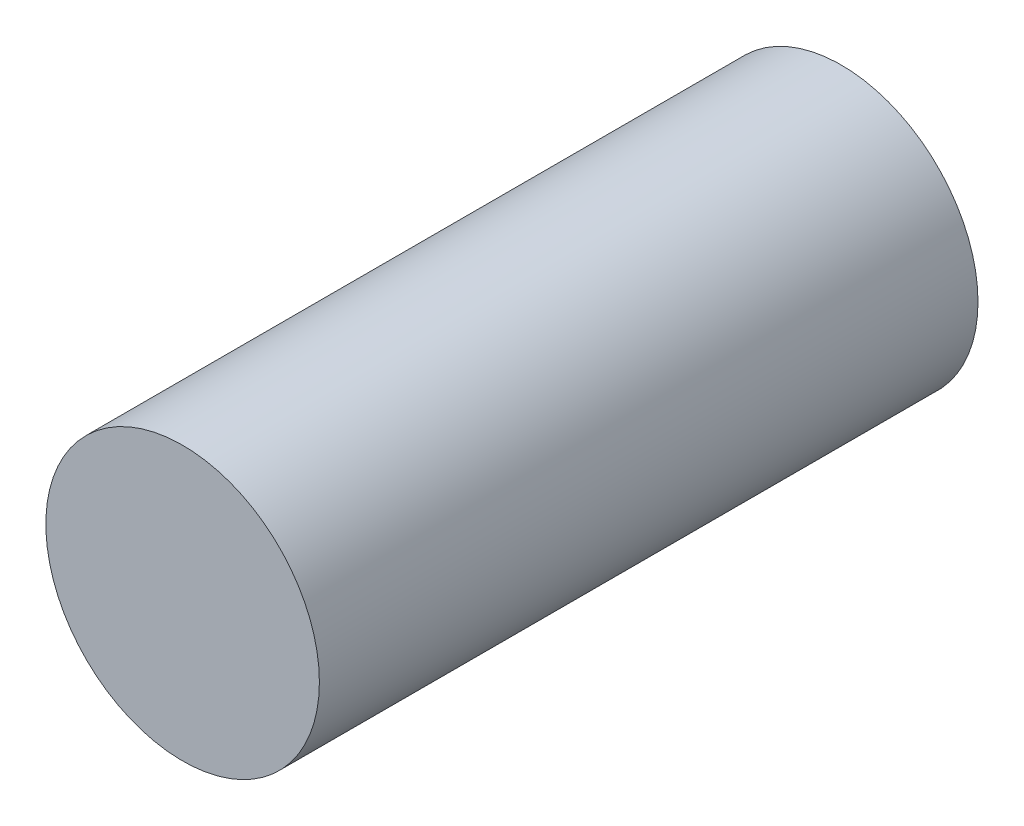
ISO-10303-21;
HEADER;
FILE_DESCRIPTION(('STEP AP214'),'2;1');
FILE_NAME('part.step','',(''),(''),'','','');
FILE_SCHEMA(('AUTOMOTIVE_DESIGN { 1 0 10303 214 1 1 1 1 }'));
ENDSEC;
DATA;
#1=APPLICATION_CONTEXT('core data for automotive mechanical design processes');
#2=APPLICATION_PROTOCOL_DEFINITION('international standard','automotive_design',2000,#1);
#3=PRODUCT_CONTEXT('',#1,'mechanical');
#4=PRODUCT('Part','Part','',(#3));
#5=PRODUCT_RELATED_PRODUCT_CATEGORY('part','',(#4));
#6=PRODUCT_DEFINITION_FORMATION('','',#4);
#7=PRODUCT_DEFINITION_CONTEXT('part definition',#1,'design');
#8=PRODUCT_DEFINITION('design','',#6,#7);
#9=PRODUCT_DEFINITION_SHAPE('','',#8);
#10=(LENGTH_UNIT() NAMED_UNIT(*) SI_UNIT(.MILLI.,.METRE.));
#11=(NAMED_UNIT(*) PLANE_ANGLE_UNIT() SI_UNIT($,.RADIAN.));
#12=(NAMED_UNIT(*) SI_UNIT($,.STERADIAN.) SOLID_ANGLE_UNIT());
#13=UNCERTAINTY_MEASURE_WITH_UNIT(LENGTH_MEASURE(1.E-05),#10,'distance_accuracy_value','');
#14=(GEOMETRIC_REPRESENTATION_CONTEXT(3) GLOBAL_UNCERTAINTY_ASSIGNED_CONTEXT((#13)) GLOBAL_UNIT_ASSIGNED_CONTEXT((#10,
#11,#12)) REPRESENTATION_CONTEXT('',''));
#15=CARTESIAN_POINT('',(0.,0.,0.));
#16=DIRECTION('',(0.,0.,1.));
#17=DIRECTION('',(1.,0.,0.));
#18=AXIS2_PLACEMENT_3D('',#15,#16,#17);
#19=CARTESIAN_POINT('',(689.,689.,-3000.));
#20=DIRECTION('',(0.,0.,1.));
#21=DIRECTION('',(1.,0.,0.));
#22=AXIS2_PLACEMENT_3D('',#19,#20,#21);
#23=CYLINDRICAL_SURFACE('',#22,623.);
#24=CARTESIAN_POINT('',(689.,689.,-3000.));
#25=DIRECTION('',(0.,0.,1.));
#26=DIRECTION('',(1.,0.,0.));
#27=AXIS2_PLACEMENT_3D('',#24,#25,#26);
#28=CIRCLE('',#27,623.);
#29=CARTESIAN_POINT('',(1312.,689.,-3000.));
#30=VERTEX_POINT('',#29);
#31=EDGE_CURVE('E10',#30,#30,#28,.T.);
#32=ORIENTED_EDGE('',*,*,#31,.T.);
#33=EDGE_LOOP('',(#32));
#34=FACE_BOUND('',#33,.T.);
#35=CARTESIAN_POINT('',(689.,689.,0.));
#36=DIRECTION('',(0.,0.,1.));
#37=DIRECTION('',(1.,0.,0.));
#38=AXIS2_PLACEMENT_3D('',#35,#36,#37);
#39=CIRCLE('',#38,623.);
#40=CARTESIAN_POINT('',(1312.,689.,0.));
#41=VERTEX_POINT('',#40);
#42=EDGE_CURVE('E30',#41,#41,#39,.T.);
#43=ORIENTED_EDGE('',*,*,#42,.F.);
#44=EDGE_LOOP('',(#43));
#45=FACE_BOUND('',#44,.T.);
#46=ADVANCED_FACE('F24',(#34,#45),#23,.T.);
#47=CARTESIAN_POINT('',(689.,689.,-3000.));
#48=DIRECTION('',(0.,0.,1.));
#49=DIRECTION('',(1.,0.,0.));
#50=AXIS2_PLACEMENT_3D('',#47,#48,#49);
#51=PLANE('',#50);
#52=ORIENTED_EDGE('',*,*,#31,.F.);
#53=EDGE_LOOP('',(#52));
#54=FACE_BOUND('',#53,.T.);
#55=ADVANCED_FACE('F39',(#54),#51,.F.);
#56=CARTESIAN_POINT('',(689.,689.,0.));
#57=DIRECTION('',(0.,0.,1.));
#58=DIRECTION('',(1.,0.,0.));
#59=AXIS2_PLACEMENT_3D('',#56,#57,#58);
#60=PLANE('',#59);
#61=ORIENTED_EDGE('',*,*,#42,.T.);
#62=EDGE_LOOP('',(#61));
#63=FACE_BOUND('',#62,.T.);
#64=ADVANCED_FACE('F36',(#63),#60,.T.);
#65=CLOSED_SHELL('',(#46,#55,#64));
#66=MANIFOLD_SOLID_BREP('B2',#65);
#67=ADVANCED_BREP_SHAPE_REPRESENTATION('',(#18,#66),#14);
#68=SHAPE_DEFINITION_REPRESENTATION(#9,#67);
ENDSEC;
END-ISO-10303-21;
